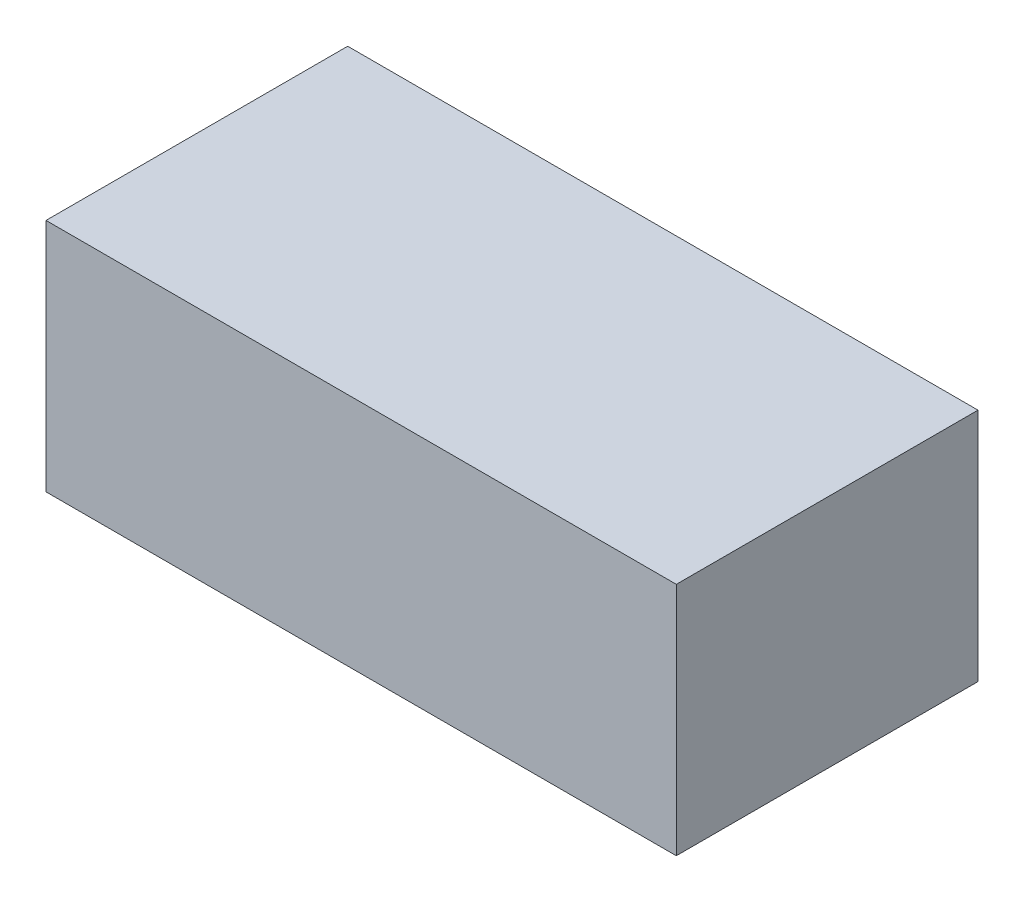
ISO-10303-21;
HEADER;
FILE_DESCRIPTION(('STEP AP214'),'2;1');
FILE_NAME('part.step','',(''),(''),'','','');
FILE_SCHEMA(('AUTOMOTIVE_DESIGN { 1 0 10303 214 1 1 1 1 }'));
ENDSEC;
DATA;
#1=APPLICATION_CONTEXT('core data for automotive mechanical design processes');
#2=APPLICATION_PROTOCOL_DEFINITION('international standard','automotive_design',2000,#1);
#3=PRODUCT_CONTEXT('',#1,'mechanical');
#4=PRODUCT('Part','Part','',(#3));
#5=PRODUCT_RELATED_PRODUCT_CATEGORY('part','',(#4));
#6=PRODUCT_DEFINITION_FORMATION('','',#4);
#7=PRODUCT_DEFINITION_CONTEXT('part definition',#1,'design');
#8=PRODUCT_DEFINITION('design','',#6,#7);
#9=PRODUCT_DEFINITION_SHAPE('','',#8);
#10=(LENGTH_UNIT() NAMED_UNIT(*) SI_UNIT(.MILLI.,.METRE.));
#11=(NAMED_UNIT(*) PLANE_ANGLE_UNIT() SI_UNIT($,.RADIAN.));
#12=(NAMED_UNIT(*) SI_UNIT($,.STERADIAN.) SOLID_ANGLE_UNIT());
#13=UNCERTAINTY_MEASURE_WITH_UNIT(LENGTH_MEASURE(1.E-05),#10,'distance_accuracy_value','');
#14=(GEOMETRIC_REPRESENTATION_CONTEXT(3) GLOBAL_UNCERTAINTY_ASSIGNED_CONTEXT((#13)) GLOBAL_UNIT_ASSIGNED_CONTEXT((#10,
#11,#12)) REPRESENTATION_CONTEXT('',''));
#15=CARTESIAN_POINT('',(0.,0.,0.));
#16=DIRECTION('',(0.,0.,1.));
#17=DIRECTION('',(1.,0.,0.));
#18=AXIS2_PLACEMENT_3D('',#15,#16,#17);
#19=CARTESIAN_POINT('',(37.,27.6,-17.71));
#20=DIRECTION('',(-1.,0.,0.));
#21=DIRECTION('',(0.,0.,1.));
#22=AXIS2_PLACEMENT_3D('',#19,#20,#21);
#23=PLANE('',#22);
#24=DIRECTION('',(0.,0.,-1.));
#25=VECTOR('',#24,1.);
#26=CARTESIAN_POINT('',(37.,0.,-17.71));
#27=LINE('',#26,#25);
#28=CARTESIAN_POINT('',(37.,0.,17.71));
#29=VERTEX_POINT('',#28);
#30=CARTESIAN_POINT('',(37.,0.,-17.71));
#31=VERTEX_POINT('',#30);
#32=EDGE_CURVE('E96',#29,#31,#27,.T.);
#33=ORIENTED_EDGE('',*,*,#32,.T.);
#34=DIRECTION('',(0.,-1.,0.));
#35=VECTOR('',#34,1.);
#36=CARTESIAN_POINT('',(37.,27.6,-17.71));
#37=LINE('',#36,#35);
#38=CARTESIAN_POINT('',(37.,27.6,-17.71));
#39=VERTEX_POINT('',#38);
#40=EDGE_CURVE('E11',#39,#31,#37,.T.);
#41=ORIENTED_EDGE('',*,*,#40,.F.);
#42=DIRECTION('',(0.,0.,-1.));
#43=VECTOR('',#42,1.);
#44=CARTESIAN_POINT('',(37.,27.6,-17.71));
#45=LINE('',#44,#43);
#46=CARTESIAN_POINT('',(37.,27.6,17.71));
#47=VERTEX_POINT('',#46);
#48=EDGE_CURVE('E84',#47,#39,#45,.T.);
#49=ORIENTED_EDGE('',*,*,#48,.F.);
#50=DIRECTION('',(0.,-1.,0.));
#51=VECTOR('',#50,1.);
#52=CARTESIAN_POINT('',(37.,27.6,17.71));
#53=LINE('',#52,#51);
#54=EDGE_CURVE('E92',#47,#29,#53,.T.);
#55=ORIENTED_EDGE('',*,*,#54,.T.);
#56=EDGE_LOOP('',(#33,#41,#49,#55));
#57=FACE_BOUND('',#56,.T.);
#58=ADVANCED_FACE('F33',(#57),#23,.F.);
#59=CARTESIAN_POINT('',(-37.,27.6,-17.71));
#60=DIRECTION('',(0.,0.,1.));
#61=DIRECTION('',(1.,0.,0.));
#62=AXIS2_PLACEMENT_3D('',#59,#60,#61);
#63=PLANE('',#62);
#64=DIRECTION('',(-1.,0.,0.));
#65=VECTOR('',#64,1.);
#66=CARTESIAN_POINT('',(-37.,0.,-17.71));
#67=LINE('',#66,#65);
#68=CARTESIAN_POINT('',(-37.,0.,-17.71));
#69=VERTEX_POINT('',#68);
#70=EDGE_CURVE('E88',#31,#69,#67,.T.);
#71=ORIENTED_EDGE('',*,*,#70,.T.);
#72=DIRECTION('',(0.,-1.,0.));
#73=VECTOR('',#72,1.);
#74=CARTESIAN_POINT('',(-37.,27.6,-17.71));
#75=LINE('',#74,#73);
#76=CARTESIAN_POINT('',(-37.,27.6,-17.71));
#77=VERTEX_POINT('',#76);
#78=EDGE_CURVE('E41',#77,#69,#75,.T.);
#79=ORIENTED_EDGE('',*,*,#78,.F.);
#80=DIRECTION('',(-1.,0.,0.));
#81=VECTOR('',#80,1.);
#82=CARTESIAN_POINT('',(-37.,27.6,-17.71));
#83=LINE('',#82,#81);
#84=EDGE_CURVE('E79',#39,#77,#83,.T.);
#85=ORIENTED_EDGE('',*,*,#84,.F.);
#86=ORIENTED_EDGE('',*,*,#40,.T.);
#87=EDGE_LOOP('',(#71,#79,#85,#86));
#88=FACE_BOUND('',#87,.T.);
#89=ADVANCED_FACE('F87',(#88),#63,.F.);
#90=CARTESIAN_POINT('',(-37.,27.6,-17.71));
#91=DIRECTION('',(1.,0.,0.));
#92=DIRECTION('',(0.,0.,-1.));
#93=AXIS2_PLACEMENT_3D('',#90,#91,#92);
#94=PLANE('',#93);
#95=DIRECTION('',(0.,0.,1.));
#96=VECTOR('',#95,1.);
#97=CARTESIAN_POINT('',(-37.,0.,-17.71));
#98=LINE('',#97,#96);
#99=CARTESIAN_POINT('',(-37.,0.,17.71));
#100=VERTEX_POINT('',#99);
#101=EDGE_CURVE('E66',#69,#100,#98,.T.);
#102=ORIENTED_EDGE('',*,*,#101,.T.);
#103=DIRECTION('',(0.,-1.,0.));
#104=VECTOR('',#103,1.);
#105=CARTESIAN_POINT('',(-37.,27.6,17.71));
#106=LINE('',#105,#104);
#107=CARTESIAN_POINT('',(-37.,27.6,17.71));
#108=VERTEX_POINT('',#107);
#109=EDGE_CURVE('E89',#108,#100,#106,.T.);
#110=ORIENTED_EDGE('',*,*,#109,.F.);
#111=DIRECTION('',(0.,0.,1.));
#112=VECTOR('',#111,1.);
#113=CARTESIAN_POINT('',(-37.,27.6,-17.71));
#114=LINE('',#113,#112);
#115=EDGE_CURVE('E82',#77,#108,#114,.T.);
#116=ORIENTED_EDGE('',*,*,#115,.F.);
#117=ORIENTED_EDGE('',*,*,#78,.T.);
#118=EDGE_LOOP('',(#102,#110,#116,#117));
#119=FACE_BOUND('',#118,.T.);
#120=ADVANCED_FACE('F90',(#119),#94,.F.);
#121=CARTESIAN_POINT('',(-37.,27.6,17.71));
#122=DIRECTION('',(0.,0.,-1.));
#123=DIRECTION('',(-1.,0.,0.));
#124=AXIS2_PLACEMENT_3D('',#121,#122,#123);
#125=PLANE('',#124);
#126=DIRECTION('',(1.,0.,0.));
#127=VECTOR('',#126,1.);
#128=CARTESIAN_POINT('',(-37.,0.,17.71));
#129=LINE('',#128,#127);
#130=EDGE_CURVE('E72',#100,#29,#129,.T.);
#131=ORIENTED_EDGE('',*,*,#130,.T.);
#132=ORIENTED_EDGE('',*,*,#54,.F.);
#133=DIRECTION('',(1.,0.,0.));
#134=VECTOR('',#133,1.);
#135=CARTESIAN_POINT('',(-37.,27.6,17.71));
#136=LINE('',#135,#134);
#137=EDGE_CURVE('E49',#108,#47,#136,.T.);
#138=ORIENTED_EDGE('',*,*,#137,.F.);
#139=ORIENTED_EDGE('',*,*,#109,.T.);
#140=EDGE_LOOP('',(#131,#132,#138,#139));
#141=FACE_BOUND('',#140,.T.);
#142=ADVANCED_FACE('F103',(#141),#125,.F.);
#143=CARTESIAN_POINT('',(0.,27.6,0.));
#144=DIRECTION('',(0.,1.,0.));
#145=DIRECTION('',(0.,0.,1.));
#146=AXIS2_PLACEMENT_3D('',#143,#144,#145);
#147=PLANE('',#146);
#148=ORIENTED_EDGE('',*,*,#48,.T.);
#149=ORIENTED_EDGE('',*,*,#84,.T.);
#150=ORIENTED_EDGE('',*,*,#115,.T.);
#151=ORIENTED_EDGE('',*,*,#137,.T.);
#152=EDGE_LOOP('',(#148,#149,#150,#151));
#153=FACE_BOUND('',#152,.T.);
#154=ADVANCED_FACE('F80',(#153),#147,.T.);
#155=CARTESIAN_POINT('',(0.,0.,0.));
#156=DIRECTION('',(0.,1.,0.));
#157=DIRECTION('',(0.,0.,1.));
#158=AXIS2_PLACEMENT_3D('',#155,#156,#157);
#159=PLANE('',#158);
#160=ORIENTED_EDGE('',*,*,#32,.F.);
#161=ORIENTED_EDGE('',*,*,#130,.F.);
#162=ORIENTED_EDGE('',*,*,#101,.F.);
#163=ORIENTED_EDGE('',*,*,#70,.F.);
#164=EDGE_LOOP('',(#160,#161,#162,#163));
#165=FACE_BOUND('',#164,.T.);
#166=ADVANCED_FACE('F106',(#165),#159,.F.);
#167=CLOSED_SHELL('',(#58,#89,#120,#142,#154,#166));
#168=MANIFOLD_SOLID_BREP('B2',#167);
#169=ADVANCED_BREP_SHAPE_REPRESENTATION('',(#18,#168),#14);
#170=SHAPE_DEFINITION_REPRESENTATION(#9,#169);
ENDSEC;
END-ISO-10303-21;
